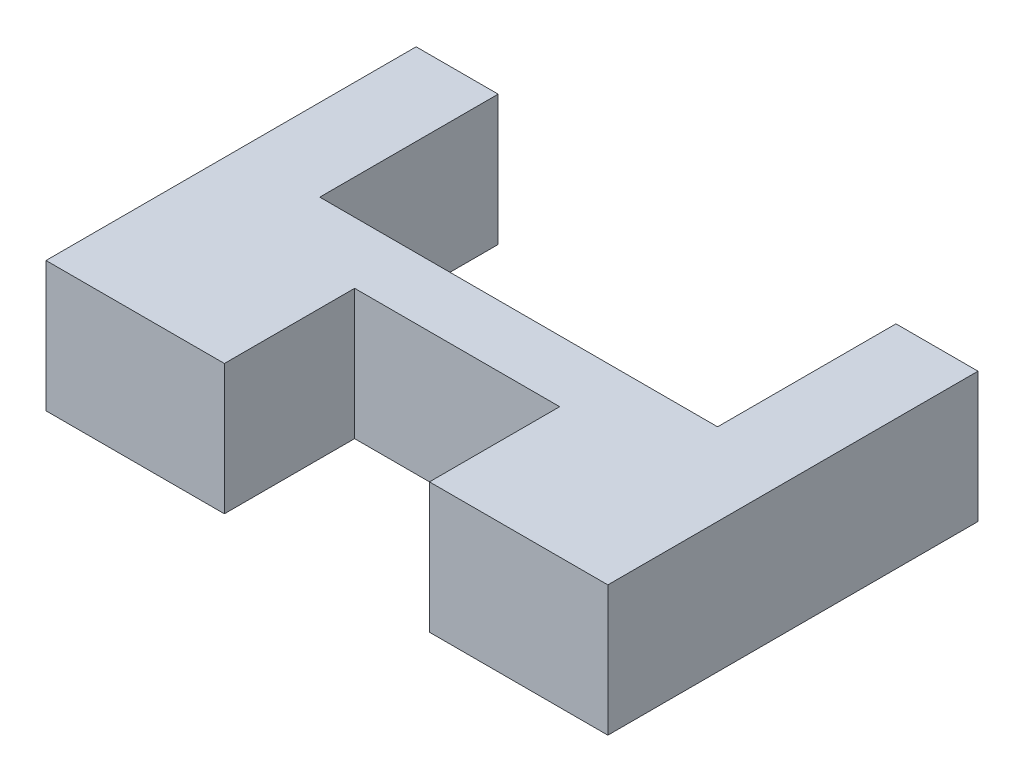
ISO-10303-21;
HEADER;
FILE_DESCRIPTION(('STEP AP214'),'2;1');
FILE_NAME('part.step','',(''),(''),'','','');
FILE_SCHEMA(('AUTOMOTIVE_DESIGN { 1 0 10303 214 1 1 1 1 }'));
ENDSEC;
DATA;
#1=APPLICATION_CONTEXT('core data for automotive mechanical design processes');
#2=APPLICATION_PROTOCOL_DEFINITION('international standard','automotive_design',2000,#1);
#3=PRODUCT_CONTEXT('',#1,'mechanical');
#4=PRODUCT('Part','Part','',(#3));
#5=PRODUCT_RELATED_PRODUCT_CATEGORY('part','',(#4));
#6=PRODUCT_DEFINITION_FORMATION('','',#4);
#7=PRODUCT_DEFINITION_CONTEXT('part definition',#1,'design');
#8=PRODUCT_DEFINITION('design','',#6,#7);
#9=PRODUCT_DEFINITION_SHAPE('','',#8);
#10=(LENGTH_UNIT() NAMED_UNIT(*) SI_UNIT(.MILLI.,.METRE.));
#11=(NAMED_UNIT(*) PLANE_ANGLE_UNIT() SI_UNIT($,.RADIAN.));
#12=(NAMED_UNIT(*) SI_UNIT($,.STERADIAN.) SOLID_ANGLE_UNIT());
#13=UNCERTAINTY_MEASURE_WITH_UNIT(LENGTH_MEASURE(1.E-05),#10,'distance_accuracy_value','');
#14=(GEOMETRIC_REPRESENTATION_CONTEXT(3) GLOBAL_UNCERTAINTY_ASSIGNED_CONTEXT((#13)) GLOBAL_UNIT_ASSIGNED_CONTEXT((#10,
#11,#12)) REPRESENTATION_CONTEXT('',''));
#15=CARTESIAN_POINT('',(0.,0.,0.));
#16=DIRECTION('',(0.,0.,1.));
#17=DIRECTION('',(1.,0.,0.));
#18=AXIS2_PLACEMENT_3D('',#15,#16,#17);
#19=CARTESIAN_POINT('',(23.4,6.35,9.35));
#20=DIRECTION('',(0.,0.,-1.));
#21=DIRECTION('',(-1.,0.,0.));
#22=AXIS2_PLACEMENT_3D('',#19,#20,#21);
#23=PLANE('',#22);
#24=DIRECTION('',(1.,0.,0.));
#25=VECTOR('',#24,1.);
#26=CARTESIAN_POINT('',(23.4,0.,9.35));
#27=LINE('',#26,#25);
#28=CARTESIAN_POINT('',(-4.,0.,9.35));
#29=VERTEX_POINT('',#28);
#30=CARTESIAN_POINT('',(4.7,0.,9.35));
#31=VERTEX_POINT('',#30);
#32=EDGE_CURVE('E150',#29,#31,#27,.T.);
#33=ORIENTED_EDGE('',*,*,#32,.T.);
#34=DIRECTION('',(0.,1.,0.));
#35=VECTOR('',#34,1.);
#36=CARTESIAN_POINT('',(4.7,-0.00100000000000013,9.35));
#37=LINE('',#36,#35);
#38=CARTESIAN_POINT('',(4.7,6.35,9.35));
#39=VERTEX_POINT('',#38);
#40=EDGE_CURVE('E188',#31,#39,#37,.T.);
#41=ORIENTED_EDGE('',*,*,#40,.T.);
#42=DIRECTION('',(1.,0.,0.));
#43=VECTOR('',#42,1.);
#44=CARTESIAN_POINT('',(23.4,6.35,9.35));
#45=LINE('',#44,#43);
#46=CARTESIAN_POINT('',(-4.,6.35,9.35));
#47=VERTEX_POINT('',#46);
#48=EDGE_CURVE('E234',#47,#39,#45,.T.);
#49=ORIENTED_EDGE('',*,*,#48,.F.);
#50=DIRECTION('',(0.,-1.,0.));
#51=VECTOR('',#50,1.);
#52=CARTESIAN_POINT('',(-4.,6.35,9.35));
#53=LINE('',#52,#51);
#54=EDGE_CURVE('E166',#47,#29,#53,.T.);
#55=ORIENTED_EDGE('',*,*,#54,.T.);
#56=EDGE_LOOP('',(#33,#41,#49,#55));
#57=FACE_BOUND('',#56,.T.);
#58=ADVANCED_FACE('F32',(#57),#23,.F.);
#59=CARTESIAN_POINT('',(0.,6.35,0.));
#60=DIRECTION('',(-1.,0.,0.));
#61=DIRECTION('',(0.,0.,1.));
#62=AXIS2_PLACEMENT_3D('',#59,#60,#61);
#63=PLANE('',#62);
#64=DIRECTION('',(0.,0.,-1.));
#65=VECTOR('',#64,1.);
#66=CARTESIAN_POINT('',(0.,0.,0.));
#67=LINE('',#66,#65);
#68=CARTESIAN_POINT('',(0.,0.,0.));
#69=VERTEX_POINT('',#68);
#70=CARTESIAN_POINT('',(0.,0.,-8.7));
#71=VERTEX_POINT('',#70);
#72=EDGE_CURVE('E141',#69,#71,#67,.T.);
#73=ORIENTED_EDGE('',*,*,#72,.T.);
#74=DIRECTION('',(0.,-1.,0.));
#75=VECTOR('',#74,1.);
#76=CARTESIAN_POINT('',(0.,6.35,-8.7));
#77=LINE('',#76,#75);
#78=CARTESIAN_POINT('',(0.,6.35,-8.7));
#79=VERTEX_POINT('',#78);
#80=EDGE_CURVE('E11',#79,#71,#77,.T.);
#81=ORIENTED_EDGE('',*,*,#80,.F.);
#82=DIRECTION('',(0.,0.,-1.));
#83=VECTOR('',#82,1.);
#84=CARTESIAN_POINT('',(0.,6.35,0.));
#85=LINE('',#84,#83);
#86=CARTESIAN_POINT('',(0.,6.35,0.));
#87=VERTEX_POINT('',#86);
#88=EDGE_CURVE('E159',#87,#79,#85,.T.);
#89=ORIENTED_EDGE('',*,*,#88,.F.);
#90=DIRECTION('',(0.,-1.,0.));
#91=VECTOR('',#90,1.);
#92=CARTESIAN_POINT('',(0.,6.35,0.));
#93=LINE('',#92,#91);
#94=EDGE_CURVE('E137',#87,#69,#93,.T.);
#95=ORIENTED_EDGE('',*,*,#94,.T.);
#96=EDGE_LOOP('',(#73,#81,#89,#95));
#97=FACE_BOUND('',#96,.T.);
#98=ADVANCED_FACE('F34',(#97),#63,.F.);
#99=CARTESIAN_POINT('',(0.,6.35,-8.7));
#100=DIRECTION('',(0.,0.,1.));
#101=DIRECTION('',(1.,0.,0.));
#102=AXIS2_PLACEMENT_3D('',#99,#100,#101);
#103=PLANE('',#102);
#104=DIRECTION('',(-1.,0.,0.));
#105=VECTOR('',#104,1.);
#106=CARTESIAN_POINT('',(0.,0.,-8.7));
#107=LINE('',#106,#105);
#108=CARTESIAN_POINT('',(-4.,0.,-8.69999999999999));
#109=VERTEX_POINT('',#108);
#110=EDGE_CURVE('E144',#71,#109,#107,.T.);
#111=ORIENTED_EDGE('',*,*,#110,.T.);
#112=DIRECTION('',(0.,-1.,0.));
#113=VECTOR('',#112,1.);
#114=CARTESIAN_POINT('',(-4.,6.35,-8.69999999999999));
#115=LINE('',#114,#113);
#116=CARTESIAN_POINT('',(-4.,6.35,-8.69999999999999));
#117=VERTEX_POINT('',#116);
#118=EDGE_CURVE('E40',#117,#109,#115,.T.);
#119=ORIENTED_EDGE('',*,*,#118,.F.);
#120=DIRECTION('',(-1.,0.,0.));
#121=VECTOR('',#120,1.);
#122=CARTESIAN_POINT('',(0.,6.35,-8.7));
#123=LINE('',#122,#121);
#124=EDGE_CURVE('E97',#79,#117,#123,.T.);
#125=ORIENTED_EDGE('',*,*,#124,.F.);
#126=ORIENTED_EDGE('',*,*,#80,.T.);
#127=EDGE_LOOP('',(#111,#119,#125,#126));
#128=FACE_BOUND('',#127,.T.);
#129=ADVANCED_FACE('F247',(#128),#103,.F.);
#130=CARTESIAN_POINT('',(-4.,6.35,-8.69999999999999));
#131=DIRECTION('',(1.,0.,0.));
#132=DIRECTION('',(0.,0.,-1.));
#133=AXIS2_PLACEMENT_3D('',#130,#131,#132);
#134=PLANE('',#133);
#135=DIRECTION('',(0.,0.,1.));
#136=VECTOR('',#135,1.);
#137=CARTESIAN_POINT('',(-4.,0.,-8.69999999999999));
#138=LINE('',#137,#136);
#139=EDGE_CURVE('E147',#109,#29,#138,.T.);
#140=ORIENTED_EDGE('',*,*,#139,.T.);
#141=ORIENTED_EDGE('',*,*,#54,.F.);
#142=DIRECTION('',(0.,0.,1.));
#143=VECTOR('',#142,1.);
#144=CARTESIAN_POINT('',(-4.,6.35,-8.69999999999999));
#145=LINE('',#144,#143);
#146=EDGE_CURVE('E174',#117,#47,#145,.T.);
#147=ORIENTED_EDGE('',*,*,#146,.F.);
#148=ORIENTED_EDGE('',*,*,#118,.T.);
#149=EDGE_LOOP('',(#140,#141,#147,#148));
#150=FACE_BOUND('',#149,.T.);
#151=ADVANCED_FACE('F172',(#150),#134,.F.);
#152=CARTESIAN_POINT('',(14.7,6.35,9.35));
#153=VERTEX_POINT('',#152);
#154=CARTESIAN_POINT('',(23.4,6.35,9.35));
#155=VERTEX_POINT('',#154);
#156=EDGE_CURVE('E233',#153,#155,#45,.T.);
#157=ORIENTED_EDGE('',*,*,#156,.F.);
#158=DIRECTION('',(0.,1.,0.));
#159=VECTOR('',#158,1.);
#160=CARTESIAN_POINT('',(14.7,-0.00100000000000013,9.35));
#161=LINE('',#160,#159);
#162=CARTESIAN_POINT('',(14.7,0.,9.35));
#163=VERTEX_POINT('',#162);
#164=EDGE_CURVE('E227',#163,#153,#161,.T.);
#165=ORIENTED_EDGE('',*,*,#164,.F.);
#166=CARTESIAN_POINT('',(23.4,0.,9.35));
#167=VERTEX_POINT('',#166);
#168=EDGE_CURVE('E149',#163,#167,#27,.T.);
#169=ORIENTED_EDGE('',*,*,#168,.T.);
#170=DIRECTION('',(0.,-1.,0.));
#171=VECTOR('',#170,1.);
#172=CARTESIAN_POINT('',(23.4,6.35,9.35));
#173=LINE('',#172,#171);
#174=EDGE_CURVE('E163',#155,#167,#173,.T.);
#175=ORIENTED_EDGE('',*,*,#174,.F.);
#176=EDGE_LOOP('',(#157,#165,#169,#175));
#177=FACE_BOUND('',#176,.T.);
#178=ADVANCED_FACE('F239',(#177),#23,.F.);
#179=CARTESIAN_POINT('',(23.4,6.35,-8.7));
#180=DIRECTION('',(-1.,0.,0.));
#181=DIRECTION('',(0.,0.,1.));
#182=AXIS2_PLACEMENT_3D('',#179,#180,#181);
#183=PLANE('',#182);
#184=DIRECTION('',(0.,0.,-1.));
#185=VECTOR('',#184,1.);
#186=CARTESIAN_POINT('',(23.4,0.,-8.7));
#187=LINE('',#186,#185);
#188=CARTESIAN_POINT('',(23.4,0.,-8.7));
#189=VERTEX_POINT('',#188);
#190=EDGE_CURVE('E153',#167,#189,#187,.T.);
#191=ORIENTED_EDGE('',*,*,#190,.T.);
#192=DIRECTION('',(0.,-1.,0.));
#193=VECTOR('',#192,1.);
#194=CARTESIAN_POINT('',(23.4,6.35,-8.7));
#195=LINE('',#194,#193);
#196=CARTESIAN_POINT('',(23.4,6.35,-8.7));
#197=VERTEX_POINT('',#196);
#198=EDGE_CURVE('E132',#197,#189,#195,.T.);
#199=ORIENTED_EDGE('',*,*,#198,.F.);
#200=DIRECTION('',(0.,0.,-1.));
#201=VECTOR('',#200,1.);
#202=CARTESIAN_POINT('',(23.4,6.35,-8.7));
#203=LINE('',#202,#201);
#204=EDGE_CURVE('E120',#155,#197,#203,.T.);
#205=ORIENTED_EDGE('',*,*,#204,.F.);
#206=ORIENTED_EDGE('',*,*,#174,.T.);
#207=EDGE_LOOP('',(#191,#199,#205,#206));
#208=FACE_BOUND('',#207,.T.);
#209=ADVANCED_FACE('F242',(#208),#183,.F.);
#210=CARTESIAN_POINT('',(19.4,6.35,-8.7));
#211=DIRECTION('',(0.,0.,1.));
#212=DIRECTION('',(1.,0.,0.));
#213=AXIS2_PLACEMENT_3D('',#210,#211,#212);
#214=PLANE('',#213);
#215=DIRECTION('',(-1.,0.,0.));
#216=VECTOR('',#215,1.);
#217=CARTESIAN_POINT('',(19.4,0.,-8.7));
#218=LINE('',#217,#216);
#219=CARTESIAN_POINT('',(19.4,0.,-8.7));
#220=VERTEX_POINT('',#219);
#221=EDGE_CURVE('E129',#189,#220,#218,.T.);
#222=ORIENTED_EDGE('',*,*,#221,.T.);
#223=DIRECTION('',(0.,-1.,0.));
#224=VECTOR('',#223,1.);
#225=CARTESIAN_POINT('',(19.4,6.35,-8.7));
#226=LINE('',#225,#224);
#227=CARTESIAN_POINT('',(19.4,6.35,-8.7));
#228=VERTEX_POINT('',#227);
#229=EDGE_CURVE('E126',#228,#220,#226,.T.);
#230=ORIENTED_EDGE('',*,*,#229,.F.);
#231=DIRECTION('',(-1.,0.,0.));
#232=VECTOR('',#231,1.);
#233=CARTESIAN_POINT('',(19.4,6.35,-8.7));
#234=LINE('',#233,#232);
#235=EDGE_CURVE('E112',#197,#228,#234,.T.);
#236=ORIENTED_EDGE('',*,*,#235,.F.);
#237=ORIENTED_EDGE('',*,*,#198,.T.);
#238=EDGE_LOOP('',(#222,#230,#236,#237));
#239=FACE_BOUND('',#238,.T.);
#240=ADVANCED_FACE('F127',(#239),#214,.F.);
#241=CARTESIAN_POINT('',(19.4,6.35,0.));
#242=DIRECTION('',(1.,0.,0.));
#243=DIRECTION('',(0.,0.,-1.));
#244=AXIS2_PLACEMENT_3D('',#241,#242,#243);
#245=PLANE('',#244);
#246=DIRECTION('',(0.,0.,1.));
#247=VECTOR('',#246,1.);
#248=CARTESIAN_POINT('',(19.4,0.,0.));
#249=LINE('',#248,#247);
#250=CARTESIAN_POINT('',(19.4,0.,0.));
#251=VERTEX_POINT('',#250);
#252=EDGE_CURVE('E156',#220,#251,#249,.T.);
#253=ORIENTED_EDGE('',*,*,#252,.T.);
#254=DIRECTION('',(0.,-1.,0.));
#255=VECTOR('',#254,1.);
#256=CARTESIAN_POINT('',(19.4,6.35,0.));
#257=LINE('',#256,#255);
#258=CARTESIAN_POINT('',(19.4,6.35,0.));
#259=VERTEX_POINT('',#258);
#260=EDGE_CURVE('E133',#259,#251,#257,.T.);
#261=ORIENTED_EDGE('',*,*,#260,.F.);
#262=DIRECTION('',(0.,0.,1.));
#263=VECTOR('',#262,1.);
#264=CARTESIAN_POINT('',(19.4,6.35,0.));
#265=LINE('',#264,#263);
#266=EDGE_CURVE('E117',#228,#259,#265,.T.);
#267=ORIENTED_EDGE('',*,*,#266,.F.);
#268=ORIENTED_EDGE('',*,*,#229,.T.);
#269=EDGE_LOOP('',(#253,#261,#267,#268));
#270=FACE_BOUND('',#269,.T.);
#271=ADVANCED_FACE('F135',(#270),#245,.F.);
#272=CARTESIAN_POINT('',(0.,6.35,0.));
#273=DIRECTION('',(0.,0.,1.));
#274=DIRECTION('',(1.,0.,0.));
#275=AXIS2_PLACEMENT_3D('',#272,#273,#274);
#276=PLANE('',#275);
#277=DIRECTION('',(-1.,0.,0.));
#278=VECTOR('',#277,1.);
#279=CARTESIAN_POINT('',(0.,0.,0.));
#280=LINE('',#279,#278);
#281=EDGE_CURVE('E89',#251,#69,#280,.T.);
#282=ORIENTED_EDGE('',*,*,#281,.T.);
#283=ORIENTED_EDGE('',*,*,#94,.F.);
#284=DIRECTION('',(-1.,0.,0.));
#285=VECTOR('',#284,1.);
#286=CARTESIAN_POINT('',(0.,6.35,0.));
#287=LINE('',#286,#285);
#288=EDGE_CURVE('E56',#259,#87,#287,.T.);
#289=ORIENTED_EDGE('',*,*,#288,.F.);
#290=ORIENTED_EDGE('',*,*,#260,.T.);
#291=EDGE_LOOP('',(#282,#283,#289,#290));
#292=FACE_BOUND('',#291,.T.);
#293=ADVANCED_FACE('F243',(#292),#276,.F.);
#294=CARTESIAN_POINT('',(0.,6.35,0.));
#295=DIRECTION('',(0.,1.,0.));
#296=DIRECTION('',(0.,0.,1.));
#297=AXIS2_PLACEMENT_3D('',#294,#295,#296);
#298=PLANE('',#297);
#299=DIRECTION('',(0.,0.,1.));
#300=VECTOR('',#299,1.);
#301=CARTESIAN_POINT('',(4.7,6.35,9.35));
#302=LINE('',#301,#300);
#303=CARTESIAN_POINT('',(4.7,6.35,3.));
#304=VERTEX_POINT('',#303);
#305=EDGE_CURVE('E215',#304,#39,#302,.T.);
#306=ORIENTED_EDGE('',*,*,#305,.F.);
#307=DIRECTION('',(-1.,0.,0.));
#308=VECTOR('',#307,1.);
#309=CARTESIAN_POINT('',(4.7,6.35,3.));
#310=LINE('',#309,#308);
#311=CARTESIAN_POINT('',(14.7,6.35,3.));
#312=VERTEX_POINT('',#311);
#313=EDGE_CURVE('E211',#312,#304,#310,.T.);
#314=ORIENTED_EDGE('',*,*,#313,.F.);
#315=DIRECTION('',(0.,0.,-1.));
#316=VECTOR('',#315,1.);
#317=CARTESIAN_POINT('',(14.7,6.35,9.35));
#318=LINE('',#317,#316);
#319=EDGE_CURVE('E222',#153,#312,#318,.T.);
#320=ORIENTED_EDGE('',*,*,#319,.F.);
#321=ORIENTED_EDGE('',*,*,#156,.T.);
#322=ORIENTED_EDGE('',*,*,#204,.T.);
#323=ORIENTED_EDGE('',*,*,#235,.T.);
#324=ORIENTED_EDGE('',*,*,#266,.T.);
#325=ORIENTED_EDGE('',*,*,#288,.T.);
#326=ORIENTED_EDGE('',*,*,#88,.T.);
#327=ORIENTED_EDGE('',*,*,#124,.T.);
#328=ORIENTED_EDGE('',*,*,#146,.T.);
#329=ORIENTED_EDGE('',*,*,#48,.T.);
#330=EDGE_LOOP('',(#306,#314,#320,#321,#322,#323,#324,#325,#326,#327,#328,#329));
#331=FACE_BOUND('',#330,.T.);
#332=ADVANCED_FACE('F115',(#331),#298,.T.);
#333=CARTESIAN_POINT('',(0.,0.,0.));
#334=DIRECTION('',(0.,1.,0.));
#335=DIRECTION('',(0.,0.,1.));
#336=AXIS2_PLACEMENT_3D('',#333,#334,#335);
#337=PLANE('',#336);
#338=DIRECTION('',(1.,0.,0.));
#339=VECTOR('',#338,1.);
#340=CARTESIAN_POINT('',(4.7,0.,3.));
#341=LINE('',#340,#339);
#342=CARTESIAN_POINT('',(4.7,0.,3.));
#343=VERTEX_POINT('',#342);
#344=CARTESIAN_POINT('',(14.7,0.,3.));
#345=VERTEX_POINT('',#344);
#346=EDGE_CURVE('E47',#343,#345,#341,.T.);
#347=ORIENTED_EDGE('',*,*,#346,.F.);
#348=DIRECTION('',(0.,0.,-1.));
#349=VECTOR('',#348,1.);
#350=CARTESIAN_POINT('',(4.7,0.,9.35));
#351=LINE('',#350,#349);
#352=EDGE_CURVE('E182',#31,#343,#351,.T.);
#353=ORIENTED_EDGE('',*,*,#352,.F.);
#354=ORIENTED_EDGE('',*,*,#32,.F.);
#355=ORIENTED_EDGE('',*,*,#139,.F.);
#356=ORIENTED_EDGE('',*,*,#110,.F.);
#357=ORIENTED_EDGE('',*,*,#72,.F.);
#358=ORIENTED_EDGE('',*,*,#281,.F.);
#359=ORIENTED_EDGE('',*,*,#252,.F.);
#360=ORIENTED_EDGE('',*,*,#221,.F.);
#361=ORIENTED_EDGE('',*,*,#190,.F.);
#362=ORIENTED_EDGE('',*,*,#168,.F.);
#363=DIRECTION('',(0.,0.,1.));
#364=VECTOR('',#363,1.);
#365=CARTESIAN_POINT('',(14.7,0.,9.35));
#366=LINE('',#365,#364);
#367=EDGE_CURVE('E206',#345,#163,#366,.T.);
#368=ORIENTED_EDGE('',*,*,#367,.F.);
#369=EDGE_LOOP('',(#347,#353,#354,#355,#356,#357,#358,#359,#360,#361,#362,#368));
#370=FACE_BOUND('',#369,.T.);
#371=ADVANCED_FACE('F177',(#370),#337,.F.);
#372=CARTESIAN_POINT('',(4.7,-0.00100000000000013,9.35));
#373=DIRECTION('',(-1.,0.,0.));
#374=DIRECTION('',(0.,0.,1.));
#375=AXIS2_PLACEMENT_3D('',#372,#373,#374);
#376=PLANE('',#375);
#377=ORIENTED_EDGE('',*,*,#352,.T.);
#378=DIRECTION('',(0.,1.,0.));
#379=VECTOR('',#378,1.);
#380=CARTESIAN_POINT('',(4.7,-0.00100000000000013,3.));
#381=LINE('',#380,#379);
#382=EDGE_CURVE('E145',#343,#304,#381,.T.);
#383=ORIENTED_EDGE('',*,*,#382,.T.);
#384=ORIENTED_EDGE('',*,*,#305,.T.);
#385=ORIENTED_EDGE('',*,*,#40,.F.);
#386=EDGE_LOOP('',(#377,#383,#384,#385));
#387=FACE_BOUND('',#386,.T.);
#388=ADVANCED_FACE('F214',(#387),#376,.F.);
#389=CARTESIAN_POINT('',(4.7,-0.00100000000000013,3.));
#390=DIRECTION('',(0.,0.,-1.));
#391=DIRECTION('',(-1.,0.,0.));
#392=AXIS2_PLACEMENT_3D('',#389,#390,#391);
#393=PLANE('',#392);
#394=ORIENTED_EDGE('',*,*,#346,.T.);
#395=DIRECTION('',(0.,1.,0.));
#396=VECTOR('',#395,1.);
#397=CARTESIAN_POINT('',(14.7,-0.00100000000000013,3.));
#398=LINE('',#397,#396);
#399=EDGE_CURVE('E212',#345,#312,#398,.T.);
#400=ORIENTED_EDGE('',*,*,#399,.T.);
#401=ORIENTED_EDGE('',*,*,#313,.T.);
#402=ORIENTED_EDGE('',*,*,#382,.F.);
#403=EDGE_LOOP('',(#394,#400,#401,#402));
#404=FACE_BOUND('',#403,.T.);
#405=ADVANCED_FACE('F209',(#404),#393,.F.);
#406=CARTESIAN_POINT('',(14.7,-0.00100000000000013,9.35));
#407=DIRECTION('',(1.,0.,0.));
#408=DIRECTION('',(0.,0.,-1.));
#409=AXIS2_PLACEMENT_3D('',#406,#407,#408);
#410=PLANE('',#409);
#411=ORIENTED_EDGE('',*,*,#367,.T.);
#412=ORIENTED_EDGE('',*,*,#164,.T.);
#413=ORIENTED_EDGE('',*,*,#319,.T.);
#414=ORIENTED_EDGE('',*,*,#399,.F.);
#415=EDGE_LOOP('',(#411,#412,#413,#414));
#416=FACE_BOUND('',#415,.T.);
#417=ADVANCED_FACE('F278',(#416),#410,.F.);
#418=CLOSED_SHELL('',(#58,#98,#129,#151,#178,#209,#240,#271,#293,#332,#371,#388,#405,#417));
#419=MANIFOLD_SOLID_BREP('B2',#418);
#420=ADVANCED_BREP_SHAPE_REPRESENTATION('',(#18,#419),#14);
#421=SHAPE_DEFINITION_REPRESENTATION(#9,#420);
ENDSEC;
END-ISO-10303-21;
